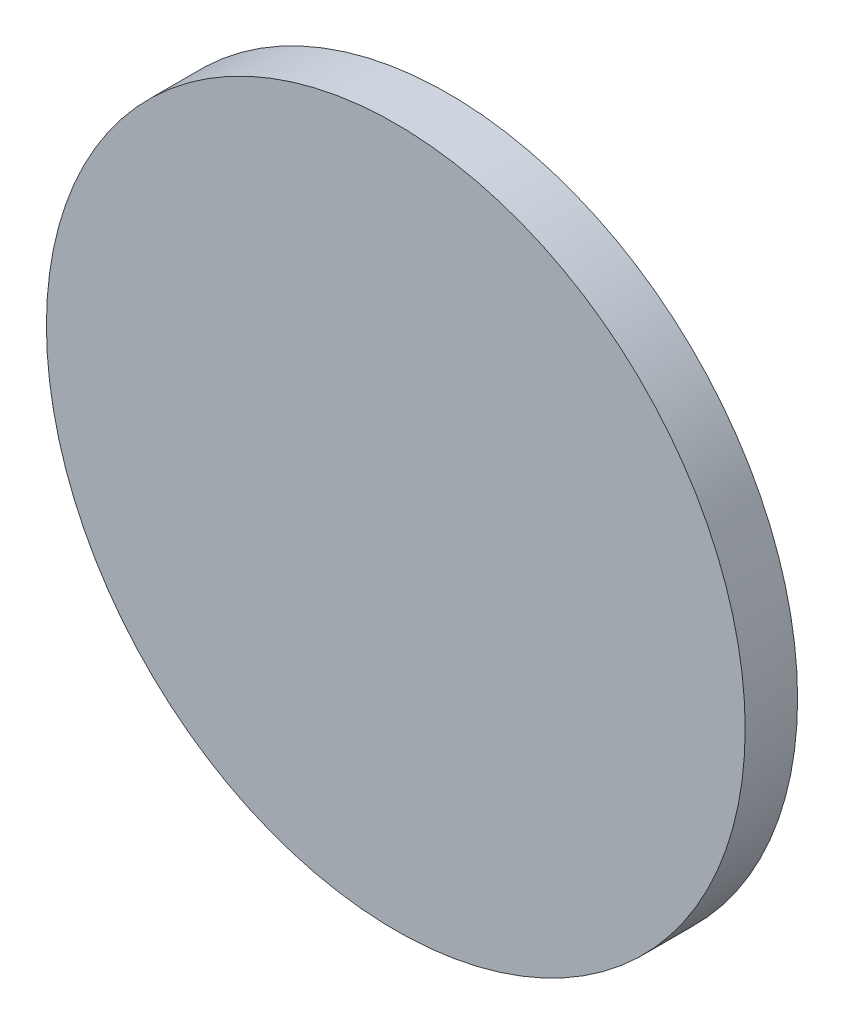
ISO-10303-21;
HEADER;
FILE_DESCRIPTION(('STEP AP214'),'2;1');
FILE_NAME('part.step','',(''),(''),'','','');
FILE_SCHEMA(('AUTOMOTIVE_DESIGN { 1 0 10303 214 1 1 1 1 }'));
ENDSEC;
DATA;
#1=APPLICATION_CONTEXT('core data for automotive mechanical design processes');
#2=APPLICATION_PROTOCOL_DEFINITION('international standard','automotive_design',2000,#1);
#3=PRODUCT_CONTEXT('',#1,'mechanical');
#4=PRODUCT('Part','Part','',(#3));
#5=PRODUCT_RELATED_PRODUCT_CATEGORY('part','',(#4));
#6=PRODUCT_DEFINITION_FORMATION('','',#4);
#7=PRODUCT_DEFINITION_CONTEXT('part definition',#1,'design');
#8=PRODUCT_DEFINITION('design','',#6,#7);
#9=PRODUCT_DEFINITION_SHAPE('','',#8);
#10=(LENGTH_UNIT() NAMED_UNIT(*) SI_UNIT(.MILLI.,.METRE.));
#11=(NAMED_UNIT(*) PLANE_ANGLE_UNIT() SI_UNIT($,.RADIAN.));
#12=(NAMED_UNIT(*) SI_UNIT($,.STERADIAN.) SOLID_ANGLE_UNIT());
#13=UNCERTAINTY_MEASURE_WITH_UNIT(LENGTH_MEASURE(1.E-05),#10,'distance_accuracy_value','');
#14=(GEOMETRIC_REPRESENTATION_CONTEXT(3) GLOBAL_UNCERTAINTY_ASSIGNED_CONTEXT((#13)) GLOBAL_UNIT_ASSIGNED_CONTEXT((#10,
#11,#12)) REPRESENTATION_CONTEXT('',''));
#15=CARTESIAN_POINT('',(0.,0.,0.));
#16=DIRECTION('',(0.,0.,1.));
#17=DIRECTION('',(1.,0.,0.));
#18=AXIS2_PLACEMENT_3D('',#15,#16,#17);
#19=CARTESIAN_POINT('',(6.25832,13.13982,0.03429));
#20=DIRECTION('',(0.,0.,1.));
#21=DIRECTION('',(1.,0.,0.));
#22=AXIS2_PLACEMENT_3D('',#19,#20,#21);
#23=PLANE('',#22);
#24=CARTESIAN_POINT('',(6.25832,13.13982,0.03429));
#25=DIRECTION('',(0.,0.,1.));
#26=DIRECTION('',(1.,0.,0.));
#27=AXIS2_PLACEMENT_3D('',#24,#25,#26);
#28=CIRCLE('',#27,0.2286);
#29=CARTESIAN_POINT('',(6.48692,13.13982,0.03429));
#30=VERTEX_POINT('',#29);
#31=EDGE_CURVE('E18',#30,#30,#28,.F.);
#32=ORIENTED_EDGE('',*,*,#31,.F.);
#33=EDGE_LOOP('',(#32));
#34=FACE_BOUND('',#33,.T.);
#35=ADVANCED_FACE('F15',(#34),#23,.T.);
#36=CARTESIAN_POINT('',(6.25832,13.13982,0.));
#37=DIRECTION('',(0.,0.,1.));
#38=DIRECTION('',(1.,0.,0.));
#39=AXIS2_PLACEMENT_3D('',#36,#37,#38);
#40=CYLINDRICAL_SURFACE('',#39,0.2286);
#41=ORIENTED_EDGE('',*,*,#31,.T.);
#42=EDGE_LOOP('',(#41));
#43=FACE_BOUND('',#42,.T.);
#44=CARTESIAN_POINT('',(6.25832,13.13982,0.));
#45=DIRECTION('',(0.,0.,1.));
#46=DIRECTION('',(1.,0.,0.));
#47=AXIS2_PLACEMENT_3D('',#44,#45,#46);
#48=CIRCLE('',#47,0.2286);
#49=CARTESIAN_POINT('',(6.48692,13.13982,0.));
#50=VERTEX_POINT('',#49);
#51=EDGE_CURVE('E10',#50,#50,#48,.F.);
#52=ORIENTED_EDGE('',*,*,#51,.F.);
#53=EDGE_LOOP('',(#52));
#54=FACE_BOUND('',#53,.T.);
#55=ADVANCED_FACE('F27',(#43,#54),#40,.T.);
#56=CARTESIAN_POINT('',(6.25832,13.13982,0.));
#57=DIRECTION('',(0.,0.,-1.));
#58=DIRECTION('',(-1.,0.,0.));
#59=AXIS2_PLACEMENT_3D('',#56,#57,#58);
#60=PLANE('',#59);
#61=ORIENTED_EDGE('',*,*,#51,.T.);
#62=EDGE_LOOP('',(#61));
#63=FACE_BOUND('',#62,.T.);
#64=ADVANCED_FACE('F35',(#63),#60,.T.);
#65=CLOSED_SHELL('',(#35,#55,#64));
#66=MANIFOLD_SOLID_BREP('B1',#65);
#67=ADVANCED_BREP_SHAPE_REPRESENTATION('',(#18,#66),#14);
#68=SHAPE_DEFINITION_REPRESENTATION(#9,#67);
ENDSEC;
END-ISO-10303-21;
